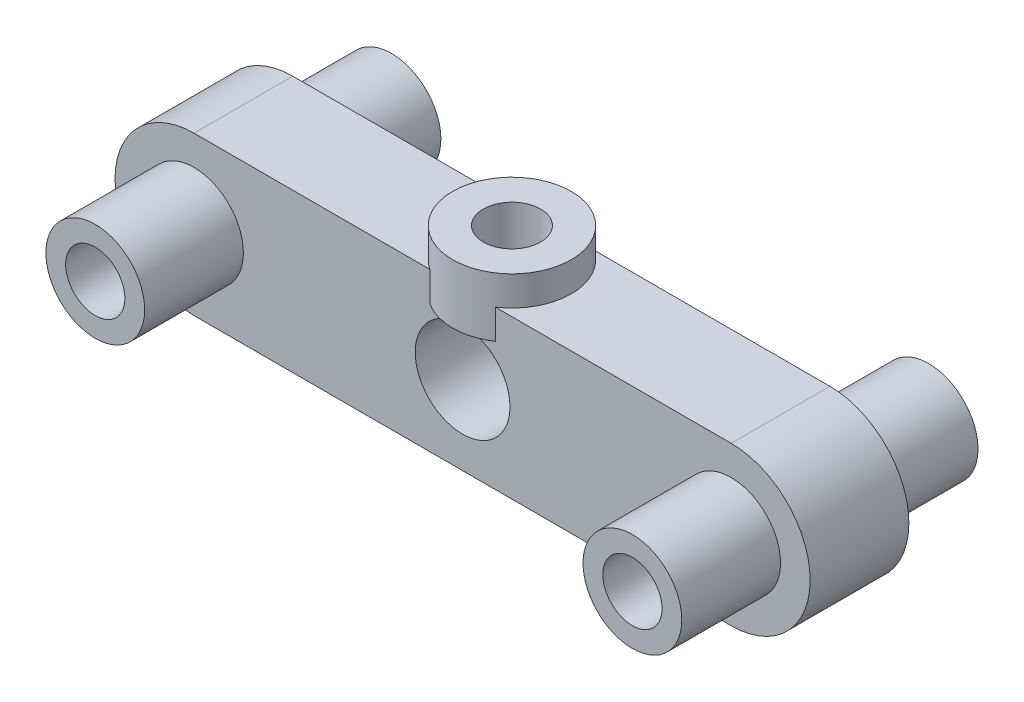
ISO-10303-21;
HEADER;
FILE_DESCRIPTION(('STEP AP214'),'2;1');
FILE_NAME('part.step','',(''),(''),'','','');
FILE_SCHEMA(('AUTOMOTIVE_DESIGN { 1 0 10303 214 1 1 1 1 }'));
ENDSEC;
DATA;
#1=APPLICATION_CONTEXT('core data for automotive mechanical design processes');
#2=APPLICATION_PROTOCOL_DEFINITION('international standard','automotive_design',2000,#1);
#3=PRODUCT_CONTEXT('',#1,'mechanical');
#4=PRODUCT('Part','Part','',(#3));
#5=PRODUCT_RELATED_PRODUCT_CATEGORY('part','',(#4));
#6=PRODUCT_DEFINITION_FORMATION('','',#4);
#7=PRODUCT_DEFINITION_CONTEXT('part definition',#1,'design');
#8=PRODUCT_DEFINITION('design','',#6,#7);
#9=PRODUCT_DEFINITION_SHAPE('','',#8);
#10=(LENGTH_UNIT() NAMED_UNIT(*) SI_UNIT(.MILLI.,.METRE.));
#11=(NAMED_UNIT(*) PLANE_ANGLE_UNIT() SI_UNIT($,.RADIAN.));
#12=(NAMED_UNIT(*) SI_UNIT($,.STERADIAN.) SOLID_ANGLE_UNIT());
#13=UNCERTAINTY_MEASURE_WITH_UNIT(LENGTH_MEASURE(1.E-05),#10,'distance_accuracy_value','');
#14=(GEOMETRIC_REPRESENTATION_CONTEXT(3) GLOBAL_UNCERTAINTY_ASSIGNED_CONTEXT((#13)) GLOBAL_UNIT_ASSIGNED_CONTEXT((#10,
#11,#12)) REPRESENTATION_CONTEXT('',''));
#15=CARTESIAN_POINT('',(0.,0.,0.));
#16=DIRECTION('',(0.,0.,1.));
#17=DIRECTION('',(1.,0.,0.));
#18=AXIS2_PLACEMENT_3D('',#15,#16,#17);
#19=CARTESIAN_POINT('',(0.,0.,0.));
#20=DIRECTION('',(0.,0.,1.));
#21=DIRECTION('',(1.,0.,0.));
#22=AXIS2_PLACEMENT_3D('',#19,#20,#21);
#23=PLANE('',#22);
#24=CARTESIAN_POINT('',(0.,0.,0.));
#25=DIRECTION('',(0.,0.,1.));
#26=DIRECTION('',(1.,0.,0.));
#27=AXIS2_PLACEMENT_3D('',#24,#25,#26);
#28=CIRCLE('',#27,1.45);
#29=CARTESIAN_POINT('',(1.45,0.,0.));
#30=VERTEX_POINT('',#29);
#31=EDGE_CURVE('E207',#30,#30,#28,.T.);
#32=ORIENTED_EDGE('',*,*,#31,.T.);
#33=EDGE_LOOP('',(#32));
#34=FACE_BOUND('',#33,.T.);
#35=CARTESIAN_POINT('',(0.,0.,0.));
#36=DIRECTION('',(0.,0.,1.));
#37=DIRECTION('',(1.,0.,0.));
#38=AXIS2_PLACEMENT_3D('',#35,#36,#37);
#39=CIRCLE('',#38,1.5);
#40=CARTESIAN_POINT('',(1.5,0.,0.));
#41=VERTEX_POINT('',#40);
#42=EDGE_CURVE('E11',#41,#41,#39,.T.);
#43=ORIENTED_EDGE('',*,*,#42,.F.);
#44=EDGE_LOOP('',(#43));
#45=FACE_BOUND('',#44,.T.);
#46=ADVANCED_FACE('F49',(#34,#45),#23,.F.);
#47=CARTESIAN_POINT('',(27.2,0.,0.));
#48=DIRECTION('',(0.,0.,1.));
#49=DIRECTION('',(1.,0.,0.));
#50=AXIS2_PLACEMENT_3D('',#47,#48,#49);
#51=CIRCLE('',#50,1.45);
#52=CARTESIAN_POINT('',(28.65,0.,0.));
#53=VERTEX_POINT('',#52);
#54=EDGE_CURVE('E211',#53,#53,#51,.T.);
#55=ORIENTED_EDGE('',*,*,#54,.T.);
#56=EDGE_LOOP('',(#55));
#57=FACE_BOUND('',#56,.T.);
#58=CARTESIAN_POINT('',(27.2,0.,0.));
#59=DIRECTION('',(0.,0.,1.));
#60=DIRECTION('',(1.,0.,0.));
#61=AXIS2_PLACEMENT_3D('',#58,#59,#60);
#62=CIRCLE('',#61,1.5);
#63=CARTESIAN_POINT('',(28.7,0.,0.));
#64=VERTEX_POINT('',#63);
#65=EDGE_CURVE('E58',#64,#64,#62,.T.);
#66=ORIENTED_EDGE('',*,*,#65,.F.);
#67=EDGE_LOOP('',(#66));
#68=FACE_BOUND('',#67,.T.);
#69=ADVANCED_FACE('F237',(#57,#68),#23,.F.);
#70=CARTESIAN_POINT('',(0.,0.,5.));
#71=DIRECTION('',(0.,0.,1.));
#72=DIRECTION('',(1.,0.,0.));
#73=AXIS2_PLACEMENT_3D('',#70,#71,#72);
#74=PLANE('',#73);
#75=CARTESIAN_POINT('',(0.,0.,5.));
#76=DIRECTION('',(0.,0.,1.));
#77=DIRECTION('',(-1.,0.,0.));
#78=AXIS2_PLACEMENT_3D('',#75,#76,#77);
#79=CIRCLE('',#78,1.45);
#80=CARTESIAN_POINT('',(-1.45,0.,5.));
#81=VERTEX_POINT('',#80);
#82=EDGE_CURVE('E305',#81,#81,#79,.T.);
#83=ORIENTED_EDGE('',*,*,#82,.F.);
#84=EDGE_LOOP('',(#83));
#85=FACE_BOUND('',#84,.T.);
#86=CARTESIAN_POINT('',(0.,0.,5.));
#87=DIRECTION('',(0.,0.,1.));
#88=DIRECTION('',(1.,0.,0.));
#89=AXIS2_PLACEMENT_3D('',#86,#87,#88);
#90=CIRCLE('',#89,1.5);
#91=CARTESIAN_POINT('',(1.5,0.,5.));
#92=VERTEX_POINT('',#91);
#93=EDGE_CURVE('E226',#92,#92,#90,.F.);
#94=ORIENTED_EDGE('',*,*,#93,.F.);
#95=EDGE_LOOP('',(#94));
#96=FACE_BOUND('',#95,.T.);
#97=ADVANCED_FACE('F239',(#85,#96),#74,.T.);
#98=CARTESIAN_POINT('',(27.2,0.,5.));
#99=DIRECTION('',(0.,0.,1.));
#100=DIRECTION('',(1.,0.,0.));
#101=AXIS2_PLACEMENT_3D('',#98,#99,#100);
#102=CIRCLE('',#101,1.45);
#103=CARTESIAN_POINT('',(28.65,0.,5.));
#104=VERTEX_POINT('',#103);
#105=EDGE_CURVE('E212',#104,#104,#102,.T.);
#106=ORIENTED_EDGE('',*,*,#105,.F.);
#107=EDGE_LOOP('',(#106));
#108=FACE_BOUND('',#107,.T.);
#109=CARTESIAN_POINT('',(27.2,0.,5.));
#110=DIRECTION('',(0.,0.,1.));
#111=DIRECTION('',(1.,0.,0.));
#112=AXIS2_PLACEMENT_3D('',#109,#110,#111);
#113=CIRCLE('',#112,1.5);
#114=CARTESIAN_POINT('',(28.7,0.,5.));
#115=VERTEX_POINT('',#114);
#116=EDGE_CURVE('E206',#115,#115,#113,.F.);
#117=ORIENTED_EDGE('',*,*,#116,.F.);
#118=EDGE_LOOP('',(#117));
#119=FACE_BOUND('',#118,.T.);
#120=ADVANCED_FACE('F248',(#108,#119),#74,.T.);
#121=CARTESIAN_POINT('',(0.,4.,5.));
#122=DIRECTION('',(0.,-1.,0.));
#123=DIRECTION('',(0.,0.,-1.));
#124=AXIS2_PLACEMENT_3D('',#121,#122,#123);
#125=PLANE('',#124);
#126=DIRECTION('',(-1.,0.,0.));
#127=VECTOR('',#126,1.);
#128=CARTESIAN_POINT('',(0.,4.,0.));
#129=LINE('',#128,#127);
#130=CARTESIAN_POINT('',(27.2,4.,0.));
#131=VERTEX_POINT('',#130);
#132=CARTESIAN_POINT('',(15.2583123951777,4.,0.));
#133=VERTEX_POINT('',#132);
#134=EDGE_CURVE('E165',#131,#133,#129,.T.);
#135=ORIENTED_EDGE('',*,*,#134,.T.);
#136=CARTESIAN_POINT('',(13.6,4.,2.5));
#137=DIRECTION('',(0.,-1.,0.));
#138=DIRECTION('',(0.,0.,-1.));
#139=AXIS2_PLACEMENT_3D('',#136,#137,#138);
#140=CIRCLE('',#139,3.);
#141=CARTESIAN_POINT('',(15.2583123951777,4.,5.));
#142=VERTEX_POINT('',#141);
#143=EDGE_CURVE('E202',#133,#142,#140,.T.);
#144=ORIENTED_EDGE('',*,*,#143,.T.);
#145=DIRECTION('',(-1.,0.,0.));
#146=VECTOR('',#145,1.);
#147=CARTESIAN_POINT('',(0.,4.,5.));
#148=LINE('',#147,#146);
#149=CARTESIAN_POINT('',(27.2,4.,5.));
#150=VERTEX_POINT('',#149);
#151=EDGE_CURVE('E171',#150,#142,#148,.T.);
#152=ORIENTED_EDGE('',*,*,#151,.F.);
#153=DIRECTION('',(0.,0.,-1.));
#154=VECTOR('',#153,1.);
#155=CARTESIAN_POINT('',(27.2,4.,5.));
#156=LINE('',#155,#154);
#157=EDGE_CURVE('E189',#150,#131,#156,.T.);
#158=ORIENTED_EDGE('',*,*,#157,.T.);
#159=EDGE_LOOP('',(#135,#144,#152,#158));
#160=FACE_BOUND('',#159,.T.);
#161=ADVANCED_FACE('F261',(#160),#125,.F.);
#162=CARTESIAN_POINT('',(0.,0.,5.));
#163=DIRECTION('',(0.,0.,1.));
#164=DIRECTION('',(1.,0.,0.));
#165=AXIS2_PLACEMENT_3D('',#162,#163,#164);
#166=CIRCLE('',#165,2.5);
#167=CARTESIAN_POINT('',(2.5,0.,5.));
#168=VERTEX_POINT('',#167);
#169=EDGE_CURVE('E426',#168,#168,#166,.T.);
#170=ORIENTED_EDGE('',*,*,#169,.F.);
#171=EDGE_LOOP('',(#170));
#172=FACE_BOUND('',#171,.T.);
#173=CARTESIAN_POINT('',(27.2,0.,5.));
#174=DIRECTION('',(0.,0.,1.));
#175=DIRECTION('',(1.,0.,0.));
#176=AXIS2_PLACEMENT_3D('',#173,#174,#175);
#177=CIRCLE('',#176,2.5);
#178=CARTESIAN_POINT('',(29.7,0.,5.));
#179=VERTEX_POINT('',#178);
#180=EDGE_CURVE('E306',#179,#179,#177,.T.);
#181=ORIENTED_EDGE('',*,*,#180,.F.);
#182=EDGE_LOOP('',(#181));
#183=FACE_BOUND('',#182,.T.);
#184=DIRECTION('',(0.,1.,0.));
#185=VECTOR('',#184,1.);
#186=CARTESIAN_POINT('',(15.2583123951777,2.5,5.));
#187=LINE('',#186,#185);
#188=CARTESIAN_POINT('',(15.2583123951777,2.5,5.));
#189=VERTEX_POINT('',#188);
#190=EDGE_CURVE('E144',#189,#142,#187,.T.);
#191=ORIENTED_EDGE('',*,*,#190,.F.);
#192=DIRECTION('',(-1.,0.,0.));
#193=VECTOR('',#192,1.);
#194=CARTESIAN_POINT('',(0.,2.5,5.));
#195=LINE('',#194,#193);
#196=CARTESIAN_POINT('',(11.9416876048223,2.5,5.));
#197=VERTEX_POINT('',#196);
#198=EDGE_CURVE('E137',#189,#197,#195,.T.);
#199=ORIENTED_EDGE('',*,*,#198,.T.);
#200=DIRECTION('',(0.,1.,0.));
#201=VECTOR('',#200,1.);
#202=CARTESIAN_POINT('',(11.9416876048223,2.5,5.));
#203=LINE('',#202,#201);
#204=CARTESIAN_POINT('',(11.9416876048223,4.,5.));
#205=VERTEX_POINT('',#204);
#206=EDGE_CURVE('E124',#205,#197,#203,.F.);
#207=ORIENTED_EDGE('',*,*,#206,.F.);
#208=CARTESIAN_POINT('',(0.,4.,5.));
#209=VERTEX_POINT('',#208);
#210=EDGE_CURVE('E74',#205,#209,#148,.T.);
#211=ORIENTED_EDGE('',*,*,#210,.T.);
#212=CARTESIAN_POINT('',(0.,0.,5.));
#213=DIRECTION('',(0.,0.,1.));
#214=DIRECTION('',(1.,0.,0.));
#215=AXIS2_PLACEMENT_3D('',#212,#213,#214);
#216=CIRCLE('',#215,4.);
#217=CARTESIAN_POINT('',(0.,-4.,5.));
#218=VERTEX_POINT('',#217);
#219=EDGE_CURVE('E162',#209,#218,#216,.T.);
#220=ORIENTED_EDGE('',*,*,#219,.T.);
#221=DIRECTION('',(1.,0.,0.));
#222=VECTOR('',#221,1.);
#223=CARTESIAN_POINT('',(0.,-4.,5.));
#224=LINE('',#223,#222);
#225=CARTESIAN_POINT('',(27.2,-4.,5.));
#226=VERTEX_POINT('',#225);
#227=EDGE_CURVE('E103',#218,#226,#224,.T.);
#228=ORIENTED_EDGE('',*,*,#227,.T.);
#229=CARTESIAN_POINT('',(27.2,0.,5.));
#230=DIRECTION('',(0.,0.,1.));
#231=DIRECTION('',(1.,0.,0.));
#232=AXIS2_PLACEMENT_3D('',#229,#230,#231);
#233=CIRCLE('',#232,4.);
#234=EDGE_CURVE('E168',#226,#150,#233,.T.);
#235=ORIENTED_EDGE('',*,*,#234,.T.);
#236=ORIENTED_EDGE('',*,*,#151,.T.);
#237=EDGE_LOOP('',(#191,#199,#207,#211,#220,#228,#235,#236));
#238=FACE_BOUND('',#237,.T.);
#239=CARTESIAN_POINT('',(13.6,0.,5.));
#240=DIRECTION('',(0.,0.,1.));
#241=DIRECTION('',(1.,0.,0.));
#242=AXIS2_PLACEMENT_3D('',#239,#240,#241);
#243=CIRCLE('',#242,2.4);
#244=CARTESIAN_POINT('',(16.,0.,5.));
#245=VERTEX_POINT('',#244);
#246=EDGE_CURVE('E153',#245,#245,#243,.T.);
#247=ORIENTED_EDGE('',*,*,#246,.F.);
#248=EDGE_LOOP('',(#247));
#249=FACE_BOUND('',#248,.T.);
#250=ADVANCED_FACE('F141',(#172,#183,#238,#249),#74,.T.);
#251=CARTESIAN_POINT('',(0.,0.,0.));
#252=DIRECTION('',(0.,0.,1.));
#253=DIRECTION('',(1.,0.,0.));
#254=AXIS2_PLACEMENT_3D('',#251,#252,#253);
#255=CIRCLE('',#254,2.5);
#256=CARTESIAN_POINT('',(2.5,0.,0.));
#257=VERTEX_POINT('',#256);
#258=EDGE_CURVE('E266',#257,#257,#255,.T.);
#259=ORIENTED_EDGE('',*,*,#258,.T.);
#260=EDGE_LOOP('',(#259));
#261=FACE_BOUND('',#260,.T.);
#262=CARTESIAN_POINT('',(27.2,0.,0.));
#263=DIRECTION('',(0.,0.,1.));
#264=DIRECTION('',(1.,0.,0.));
#265=AXIS2_PLACEMENT_3D('',#262,#263,#264);
#266=CIRCLE('',#265,2.5);
#267=CARTESIAN_POINT('',(29.7,0.,0.));
#268=VERTEX_POINT('',#267);
#269=EDGE_CURVE('E270',#268,#268,#266,.T.);
#270=ORIENTED_EDGE('',*,*,#269,.T.);
#271=EDGE_LOOP('',(#270));
#272=FACE_BOUND('',#271,.T.);
#273=DIRECTION('',(-1.,0.,0.));
#274=VECTOR('',#273,1.);
#275=CARTESIAN_POINT('',(0.,2.5,0.));
#276=LINE('',#275,#274);
#277=CARTESIAN_POINT('',(15.2583123951777,2.5,0.));
#278=VERTEX_POINT('',#277);
#279=CARTESIAN_POINT('',(11.9416876048223,2.5,0.));
#280=VERTEX_POINT('',#279);
#281=EDGE_CURVE('E203',#278,#280,#276,.T.);
#282=ORIENTED_EDGE('',*,*,#281,.F.);
#283=DIRECTION('',(0.,1.,0.));
#284=VECTOR('',#283,1.);
#285=CARTESIAN_POINT('',(15.2583123951777,2.5,0.));
#286=LINE('',#285,#284);
#287=EDGE_CURVE('E133',#278,#133,#286,.T.);
#288=ORIENTED_EDGE('',*,*,#287,.T.);
#289=ORIENTED_EDGE('',*,*,#134,.F.);
#290=CARTESIAN_POINT('',(27.2,0.,0.));
#291=DIRECTION('',(0.,0.,1.));
#292=DIRECTION('',(1.,0.,0.));
#293=AXIS2_PLACEMENT_3D('',#290,#291,#292);
#294=CIRCLE('',#293,4.);
#295=CARTESIAN_POINT('',(27.2,-4.,0.));
#296=VERTEX_POINT('',#295);
#297=EDGE_CURVE('E181',#296,#131,#294,.T.);
#298=ORIENTED_EDGE('',*,*,#297,.F.);
#299=DIRECTION('',(1.,0.,0.));
#300=VECTOR('',#299,1.);
#301=CARTESIAN_POINT('',(0.,-4.,0.));
#302=LINE('',#301,#300);
#303=CARTESIAN_POINT('',(0.,-4.,0.));
#304=VERTEX_POINT('',#303);
#305=EDGE_CURVE('E178',#304,#296,#302,.T.);
#306=ORIENTED_EDGE('',*,*,#305,.F.);
#307=CARTESIAN_POINT('',(0.,0.,0.));
#308=DIRECTION('',(0.,0.,1.));
#309=DIRECTION('',(1.,0.,0.));
#310=AXIS2_PLACEMENT_3D('',#307,#308,#309);
#311=CIRCLE('',#310,4.);
#312=CARTESIAN_POINT('',(0.,4.,0.));
#313=VERTEX_POINT('',#312);
#314=EDGE_CURVE('E160',#313,#304,#311,.T.);
#315=ORIENTED_EDGE('',*,*,#314,.F.);
#316=CARTESIAN_POINT('',(11.9416876048223,4.,0.));
#317=VERTEX_POINT('',#316);
#318=EDGE_CURVE('E95',#317,#313,#129,.T.);
#319=ORIENTED_EDGE('',*,*,#318,.F.);
#320=DIRECTION('',(0.,1.,0.));
#321=VECTOR('',#320,1.);
#322=CARTESIAN_POINT('',(11.9416876048223,2.5,0.));
#323=LINE('',#322,#321);
#324=EDGE_CURVE('E65',#317,#280,#323,.F.);
#325=ORIENTED_EDGE('',*,*,#324,.T.);
#326=EDGE_LOOP('',(#282,#288,#289,#298,#306,#315,#319,#325));
#327=FACE_BOUND('',#326,.T.);
#328=CARTESIAN_POINT('',(13.6,0.,0.));
#329=DIRECTION('',(0.,0.,1.));
#330=DIRECTION('',(1.,0.,0.));
#331=AXIS2_PLACEMENT_3D('',#328,#329,#330);
#332=CIRCLE('',#331,2.4);
#333=CARTESIAN_POINT('',(16.,0.,0.));
#334=VERTEX_POINT('',#333);
#335=EDGE_CURVE('E146',#334,#334,#332,.T.);
#336=ORIENTED_EDGE('',*,*,#335,.T.);
#337=EDGE_LOOP('',(#336));
#338=FACE_BOUND('',#337,.T.);
#339=ADVANCED_FACE('F242',(#261,#272,#327,#338),#23,.F.);
#340=CARTESIAN_POINT('',(0.,0.,5.));
#341=DIRECTION('',(0.,0.,-1.));
#342=DIRECTION('',(-1.,0.,0.));
#343=AXIS2_PLACEMENT_3D('',#340,#341,#342);
#344=CYLINDRICAL_SURFACE('',#343,4.);
#345=ORIENTED_EDGE('',*,*,#314,.T.);
#346=DIRECTION('',(0.,0.,-1.));
#347=VECTOR('',#346,1.);
#348=CARTESIAN_POINT('',(0.,-4.,5.));
#349=LINE('',#348,#347);
#350=EDGE_CURVE('E197',#218,#304,#349,.T.);
#351=ORIENTED_EDGE('',*,*,#350,.F.);
#352=ORIENTED_EDGE('',*,*,#219,.F.);
#353=DIRECTION('',(0.,0.,-1.));
#354=VECTOR('',#353,1.);
#355=CARTESIAN_POINT('',(0.,4.,5.));
#356=LINE('',#355,#354);
#357=EDGE_CURVE('E174',#209,#313,#356,.T.);
#358=ORIENTED_EDGE('',*,*,#357,.T.);
#359=EDGE_LOOP('',(#345,#351,#352,#358));
#360=FACE_BOUND('',#359,.T.);
#361=ADVANCED_FACE('F51',(#360),#344,.T.);
#362=CARTESIAN_POINT('',(0.,-4.,5.));
#363=DIRECTION('',(0.,1.,0.));
#364=DIRECTION('',(0.,0.,1.));
#365=AXIS2_PLACEMENT_3D('',#362,#363,#364);
#366=PLANE('',#365);
#367=ORIENTED_EDGE('',*,*,#305,.T.);
#368=DIRECTION('',(0.,0.,-1.));
#369=VECTOR('',#368,1.);
#370=CARTESIAN_POINT('',(27.2,-4.,5.));
#371=LINE('',#370,#369);
#372=EDGE_CURVE('E193',#226,#296,#371,.T.);
#373=ORIENTED_EDGE('',*,*,#372,.F.);
#374=ORIENTED_EDGE('',*,*,#227,.F.);
#375=ORIENTED_EDGE('',*,*,#350,.T.);
#376=EDGE_LOOP('',(#367,#373,#374,#375));
#377=FACE_BOUND('',#376,.T.);
#378=ADVANCED_FACE('F258',(#377),#366,.F.);
#379=CARTESIAN_POINT('',(27.2,0.,5.));
#380=DIRECTION('',(0.,0.,-1.));
#381=DIRECTION('',(-1.,0.,0.));
#382=AXIS2_PLACEMENT_3D('',#379,#380,#381);
#383=CYLINDRICAL_SURFACE('',#382,4.);
#384=ORIENTED_EDGE('',*,*,#297,.T.);
#385=ORIENTED_EDGE('',*,*,#157,.F.);
#386=ORIENTED_EDGE('',*,*,#234,.F.);
#387=ORIENTED_EDGE('',*,*,#372,.T.);
#388=EDGE_LOOP('',(#384,#385,#386,#387));
#389=FACE_BOUND('',#388,.T.);
#390=ADVANCED_FACE('F290',(#389),#383,.T.);
#391=ORIENTED_EDGE('',*,*,#210,.F.);
#392=EDGE_CURVE('E130',#205,#317,#140,.T.);
#393=ORIENTED_EDGE('',*,*,#392,.T.);
#394=ORIENTED_EDGE('',*,*,#318,.T.);
#395=ORIENTED_EDGE('',*,*,#357,.F.);
#396=EDGE_LOOP('',(#391,#393,#394,#395));
#397=FACE_BOUND('',#396,.T.);
#398=ADVANCED_FACE('F279',(#397),#125,.F.);
#399=CARTESIAN_POINT('',(13.6,0.,5.));
#400=DIRECTION('',(0.,0.,-1.));
#401=DIRECTION('',(-1.,0.,0.));
#402=AXIS2_PLACEMENT_3D('',#399,#400,#401);
#403=CYLINDRICAL_SURFACE('',#402,2.4);
#404=CARTESIAN_POINT('',(12.15,1.91245914989053,2.5));
#405=CARTESIAN_POINT('',(12.1500101565943,1.91247379180866,2.42731646557288));
#406=CARTESIAN_POINT('',(12.1555140795533,1.91667918503255,2.35451512219227));
#407=CARTESIAN_POINT('',(12.1771752753107,1.93280513897264,2.21128461719401));
#408=CARTESIAN_POINT('',(12.1933656308505,1.94474965612285,2.14086353828301));
#409=CARTESIAN_POINT('',(12.2352973360836,1.97439453655365,2.00491672855246));
#410=CARTESIAN_POINT('',(12.2609605513339,1.99204767013351,1.93935607708928));
#411=CARTESIAN_POINT('',(12.3208807759894,2.0310413377372,1.81354923389214));
#412=CARTESIAN_POINT('',(12.3551369116106,2.05238149677165,1.75330250264561));
#413=CARTESIAN_POINT('',(12.4362405864687,2.09955383443775,1.63157804693358));
#414=CARTESIAN_POINT('',(12.4841241983416,2.12561460815905,1.57087894562029));
#415=CARTESIAN_POINT('',(12.5890043587751,2.17745614164241,1.45772107670103));
#416=CARTESIAN_POINT('',(12.6460084655696,2.20323665005583,1.40526921576568));
#417=CARTESIAN_POINT('',(12.7751119332333,2.25497358418559,1.30439040495826));
#418=CARTESIAN_POINT('',(12.8481820101548,2.28063744290677,1.25704078846955));
#419=CARTESIAN_POINT('',(13.0030963313752,2.32598278530178,1.17567466834384));
#420=CARTESIAN_POINT('',(13.0849322806411,2.34566985824538,1.14164569905433));
#421=CARTESIAN_POINT('',(13.2467169470789,2.37513898261201,1.09139915242136));
#422=CARTESIAN_POINT('',(13.3260859840848,2.3856934152669,1.07377988743637));
#423=CARTESIAN_POINT('',(13.4872818953652,2.39870995875905,1.05210883513017));
#424=CARTESIAN_POINT('',(13.5691063376862,2.40117982628165,1.04804404298475));
#425=CARTESIAN_POINT('',(13.7217943866822,2.39796977014427,1.05336344618846));
#426=CARTESIAN_POINT('',(13.7927431658763,2.39327504499147,1.0611216680991));
#427=CARTESIAN_POINT('',(13.932110244702,2.37794376130261,1.0867687797553));
#428=CARTESIAN_POINT('',(14.0005283532057,2.36730675495106,1.10465843301573));
#429=CARTESIAN_POINT('',(14.1335089218343,2.3409386256409,1.14987720549146));
#430=CARTESIAN_POINT('',(14.198049027884,2.32518080562213,1.17725584585147));
#431=CARTESIAN_POINT('',(14.3216935649292,2.28982509817777,1.24044295342338));
#432=CARTESIAN_POINT('',(14.3807966103276,2.27022623585082,1.27625356123277));
#433=CARTESIAN_POINT('',(14.4995135810191,2.22606211117948,1.36014197324983));
#434=CARTESIAN_POINT('',(14.5583333539926,2.20118302254125,1.40917733782279));
#435=CARTESIAN_POINT('',(14.6674151528151,2.15040783828845,1.51564965506741));
#436=CARTESIAN_POINT('',(14.7176652283073,2.12451038346858,1.57309813570507));
#437=CARTESIAN_POINT('',(14.8141955837336,2.07101840343846,1.70280573223694));
#438=CARTESIAN_POINT('',(14.8593027471235,2.04358561540304,1.77601297995626));
#439=CARTESIAN_POINT('',(14.9363400881795,1.99406694870243,1.93068180403552));
#440=CARTESIAN_POINT('',(14.9682945987536,1.97197122784944,2.01212778733733));
#441=CARTESIAN_POINT('',(15.0111431365432,1.94143914315396,2.16009783780526));
#442=CARTESIAN_POINT('',(15.0253066393308,1.93096814651298,2.2252543157333));
#443=CARTESIAN_POINT('',(15.0445318811462,1.91663199512447,2.35758037635779));
#444=CARTESIAN_POINT('',(15.0496045003344,1.91275894409191,2.4247474546612));
#445=CARTESIAN_POINT('',(15.0503514341864,1.91219276521747,2.55926533299643));
#446=CARTESIAN_POINT('',(15.0460114480318,1.91551056261516,2.62661625709447));
#447=CARTESIAN_POINT('',(15.0281784491639,1.92884015309191,2.75943094962891));
#448=CARTESIAN_POINT('',(15.0146781307808,1.93885728902483,2.82489316828397));
#449=CARTESIAN_POINT('',(14.9792890403242,1.96418607483583,2.95211871271675));
#450=CARTESIAN_POINT('',(14.9574304193315,1.97947867524178,3.01389442151066));
#451=CARTESIAN_POINT('',(14.9061047391239,2.0137130888461,3.13309313894611));
#452=CARTESIAN_POINT('',(14.8766348428032,2.03265626212722,3.1905145141612));
#453=CARTESIAN_POINT('',(14.8047365415927,2.07621753386037,3.31046263714574));
#454=CARTESIAN_POINT('',(14.7609255594031,2.10124083605449,3.37201448268204));
#455=CARTESIAN_POINT('',(14.6643971578831,2.15175091345617,3.48753890871226));
#456=CARTESIAN_POINT('',(14.6116710724192,2.17723811789046,3.54150401995677));
#457=CARTESIAN_POINT('',(14.4903274165226,2.2298550198705,3.6476748519681));
#458=CARTESIAN_POINT('',(14.4205257220205,2.25674287254008,3.6986624181704));
#459=CARTESIAN_POINT('',(14.2716378520505,2.30543291181954,3.78799153592953));
#460=CARTESIAN_POINT('',(14.1925576321274,2.32723833409791,3.82634113976635));
#461=CARTESIAN_POINT('',(14.0330528871574,2.36191505394789,3.88625224789114));
#462=CARTESIAN_POINT('',(13.9531212852373,2.37531021141657,3.90881133419387));
#463=CARTESIAN_POINT('',(13.7896824668653,2.39389980186034,3.93993648453149));
#464=CARTESIAN_POINT('',(13.7061795576304,2.39910384245561,3.94851894260598));
#465=CARTESIAN_POINT('',(13.5502773254942,2.40057696563398,3.95095303099027));
#466=CARTESIAN_POINT('',(13.4779095376563,2.39796310094531,3.9466462667786));
#467=CARTESIAN_POINT('',(13.3351245202578,2.38641328056656,3.92742007897259));
#468=CARTESIAN_POINT('',(13.2647072970332,2.37747730434275,3.91250062090904));
#469=CARTESIAN_POINT('',(13.1290173202399,2.35432165788027,3.87316296015259));
#470=CARTESIAN_POINT('',(13.0636724724688,2.34020508102566,3.84892968390394));
#471=CARTESIAN_POINT('',(12.9379760161301,2.30780026077909,3.79189474362211));
#472=CARTESIAN_POINT('',(12.8776254526894,2.28951114721595,3.75909129209479));
#473=CARTESIAN_POINT('',(12.7565965596495,2.24793109493194,3.68189083782577));
#474=CARTESIAN_POINT('',(12.6965865606403,2.22431329983709,3.63662442184387));
#475=CARTESIAN_POINT('',(12.5845490468541,2.17545481469601,3.53776272406993));
#476=CARTESIAN_POINT('',(12.5325309284569,2.15021226307111,3.48415778505678));
#477=CARTESIAN_POINT('',(12.4310030699826,2.09693588595498,3.36200441933285));
#478=CARTESIAN_POINT('',(12.3826991444413,2.06896593965901,3.2924192239187));
#479=CARTESIAN_POINT('',(12.2984541752325,2.01703594337409,3.14473471097648));
#480=CARTESIAN_POINT('',(12.2625032666458,1.99307270158462,3.06664225316196));
#481=CARTESIAN_POINT('',(12.2110697068767,1.9574533219783,2.92177390628711));
#482=CARTESIAN_POINT('',(12.1928088742355,1.94424379859729,2.85636620270286));
#483=CARTESIAN_POINT('',(12.1656133748831,1.92427475374827,2.72280224892782));
#484=CARTESIAN_POINT('',(12.1566475607767,1.91749369721491,2.65465597838959));
#485=CARTESIAN_POINT('',(12.1508514615083,1.91310320733193,2.55747959038812));
#486=CARTESIAN_POINT('',(12.1499959826934,1.91245335847346,2.52874901076056));
#487=CARTESIAN_POINT('',(12.15,1.91245914989053,2.5));
#488=B_SPLINE_CURVE_WITH_KNOTS('',3,(#404,#405,#406,#407,#408,#409,#410,#411,#412,#413,#414,
#415,#416,#417,#418,#419,#420,#421,#422,#423,#424,#425,#426,#427,#428,#429,#430,#431,#432,#433,
#434,#435,#436,#437,#438,#439,#440,#441,#442,#443,#444,#445,#446,#447,#448,#449,#450,#451,#452,
#453,#454,#455,#456,#457,#458,#459,#460,#461,#462,#463,#464,#465,#466,#467,#468,#469,#470,#471,
#472,#473,#474,#475,#476,#477,#478,#479,#480,#481,#482,#483,#484,#485,#486,#487),.UNSPECIFIED.,
.T.,.F.,(4,2,2,2,2,2,2,2,2,2,2,2,2,2,2,2,2,2,2,2,2,2,2,2,2,2,2,2,2,2,2,2,2,2,2,2,2,2,2,2,2,4),
(0.,0.217948064445006,0.436574030651572,0.653435606772189,0.870275139929569,1.11408035014652,
1.35808866045615,1.62893671925055,1.89953070512314,2.14401779580844,2.38827024602435,
2.60182681795742,2.81539948587102,3.03010396182938,3.24486300302773,3.48546173254142,
3.72639327876408,3.99583075564257,4.26476749785747,4.4663899284069,4.6677708914369,
4.86945803216088,5.0713062144505,5.27243303174852,5.47363492762341,5.71148172420783,
5.94956106869435,6.21973915121176,6.48974475538173,6.74060501318256,6.99117080919529,
7.20772121368279,7.42427232151252,7.63672908998205,7.84923020629942,8.08467810462293,
8.32040074437507,8.58677642910808,8.85293889342874,9.05965305121431,9.26567225333029,
9.3518787277314),.UNSPECIFIED.);
#489=CARTESIAN_POINT('',(12.15,1.91245914989053,2.5));
#490=VERTEX_POINT('',#489);
#491=EDGE_CURVE('E221',#490,#490,#488,.T.);
#492=ORIENTED_EDGE('',*,*,#491,.F.);
#493=EDGE_LOOP('',(#492));
#494=FACE_BOUND('',#493,.T.);
#495=ORIENTED_EDGE('',*,*,#246,.T.);
#496=EDGE_LOOP('',(#495));
#497=FACE_BOUND('',#496,.T.);
#498=ORIENTED_EDGE('',*,*,#335,.F.);
#499=EDGE_LOOP('',(#498));
#500=FACE_BOUND('',#499,.T.);
#501=ADVANCED_FACE('F276',(#494,#497,#500),#403,.F.);
#502=CARTESIAN_POINT('',(13.6,2.5,2.5));
#503=DIRECTION('',(0.,1.,0.));
#504=DIRECTION('',(-1.,0.,0.));
#505=AXIS2_PLACEMENT_3D('',#502,#503,#504);
#506=PLANE('',#505);
#507=CARTESIAN_POINT('',(13.6,2.5,2.5));
#508=DIRECTION('',(0.,1.,0.));
#509=DIRECTION('',(-1.,0.,0.));
#510=AXIS2_PLACEMENT_3D('',#507,#508,#509);
#511=CIRCLE('',#510,3.);
#512=EDGE_CURVE('E139',#278,#280,#511,.T.);
#513=ORIENTED_EDGE('',*,*,#512,.F.);
#514=ORIENTED_EDGE('',*,*,#281,.T.);
#515=EDGE_LOOP('',(#513,#514));
#516=FACE_BOUND('',#515,.T.);
#517=ADVANCED_FACE('F278',(#516),#506,.F.);
#518=CARTESIAN_POINT('',(13.6,2.5,2.5));
#519=DIRECTION('',(0.,1.,0.));
#520=DIRECTION('',(-1.,0.,0.));
#521=AXIS2_PLACEMENT_3D('',#518,#519,#520);
#522=CYLINDRICAL_SURFACE('',#521,3.);
#523=EDGE_CURVE('E128',#197,#189,#511,.T.);
#524=ORIENTED_EDGE('',*,*,#523,.T.);
#525=ORIENTED_EDGE('',*,*,#190,.T.);
#526=ORIENTED_EDGE('',*,*,#143,.F.);
#527=ORIENTED_EDGE('',*,*,#287,.F.);
#528=ORIENTED_EDGE('',*,*,#512,.T.);
#529=ORIENTED_EDGE('',*,*,#324,.F.);
#530=ORIENTED_EDGE('',*,*,#392,.F.);
#531=ORIENTED_EDGE('',*,*,#206,.T.);
#532=EDGE_LOOP('',(#524,#525,#526,#527,#528,#529,#530,#531));
#533=FACE_BOUND('',#532,.T.);
#534=CARTESIAN_POINT('',(13.6,5.5,2.5));
#535=DIRECTION('',(0.,1.,0.));
#536=DIRECTION('',(-1.,0.,0.));
#537=AXIS2_PLACEMENT_3D('',#534,#535,#536);
#538=CIRCLE('',#537,3.);
#539=CARTESIAN_POINT('',(10.6,5.5,2.5));
#540=VERTEX_POINT('',#539);
#541=EDGE_CURVE('E216',#540,#540,#538,.T.);
#542=ORIENTED_EDGE('',*,*,#541,.F.);
#543=EDGE_LOOP('',(#542));
#544=FACE_BOUND('',#543,.T.);
#545=ADVANCED_FACE('F126',(#533,#544),#522,.T.);
#546=ORIENTED_EDGE('',*,*,#198,.F.);
#547=ORIENTED_EDGE('',*,*,#523,.F.);
#548=EDGE_LOOP('',(#546,#547));
#549=FACE_BOUND('',#548,.T.);
#550=ADVANCED_FACE('F136',(#549),#506,.F.);
#551=CARTESIAN_POINT('',(13.6,5.5,2.5));
#552=DIRECTION('',(0.,1.,0.));
#553=DIRECTION('',(-1.,0.,0.));
#554=AXIS2_PLACEMENT_3D('',#551,#552,#553);
#555=PLANE('',#554);
#556=CARTESIAN_POINT('',(13.6,5.5,2.5));
#557=DIRECTION('',(0.,1.,0.));
#558=DIRECTION('',(-1.,0.,0.));
#559=AXIS2_PLACEMENT_3D('',#556,#557,#558);
#560=CIRCLE('',#559,1.45);
#561=CARTESIAN_POINT('',(12.15,5.5,2.5));
#562=VERTEX_POINT('',#561);
#563=EDGE_CURVE('E217',#562,#562,#560,.T.);
#564=ORIENTED_EDGE('',*,*,#563,.F.);
#565=EDGE_LOOP('',(#564));
#566=FACE_BOUND('',#565,.T.);
#567=ORIENTED_EDGE('',*,*,#541,.T.);
#568=EDGE_LOOP('',(#567));
#569=FACE_BOUND('',#568,.T.);
#570=ADVANCED_FACE('F323',(#566,#569),#555,.T.);
#571=CARTESIAN_POINT('',(0.,0.,-4.));
#572=DIRECTION('',(0.,0.,1.));
#573=DIRECTION('',(1.,0.,0.));
#574=AXIS2_PLACEMENT_3D('',#571,#572,#573);
#575=CYLINDRICAL_SURFACE('',#574,1.45);
#576=ORIENTED_EDGE('',*,*,#82,.T.);
#577=EDGE_LOOP('',(#576));
#578=FACE_BOUND('',#577,.T.);
#579=ORIENTED_EDGE('',*,*,#31,.F.);
#580=EDGE_LOOP('',(#579));
#581=FACE_BOUND('',#580,.T.);
#582=ADVANCED_FACE('F320',(#578,#581),#575,.F.);
#583=CARTESIAN_POINT('',(27.2,0.,-4.));
#584=DIRECTION('',(0.,0.,1.));
#585=DIRECTION('',(1.,0.,0.));
#586=AXIS2_PLACEMENT_3D('',#583,#584,#585);
#587=CYLINDRICAL_SURFACE('',#586,1.45);
#588=ORIENTED_EDGE('',*,*,#105,.T.);
#589=EDGE_LOOP('',(#588));
#590=FACE_BOUND('',#589,.T.);
#591=ORIENTED_EDGE('',*,*,#54,.F.);
#592=EDGE_LOOP('',(#591));
#593=FACE_BOUND('',#592,.T.);
#594=ADVANCED_FACE('F315',(#590,#593),#587,.F.);
#595=CARTESIAN_POINT('',(13.6,0.,2.5));
#596=DIRECTION('',(0.,1.,0.));
#597=DIRECTION('',(-1.,0.,0.));
#598=AXIS2_PLACEMENT_3D('',#595,#596,#597);
#599=CYLINDRICAL_SURFACE('',#598,1.45);
#600=ORIENTED_EDGE('',*,*,#491,.T.);
#601=EDGE_LOOP('',(#600));
#602=FACE_BOUND('',#601,.T.);
#603=ORIENTED_EDGE('',*,*,#563,.T.);
#604=EDGE_LOOP('',(#603));
#605=FACE_BOUND('',#604,.T.);
#606=ADVANCED_FACE('F309',(#602,#605),#599,.F.);
#607=CARTESIAN_POINT('',(27.2,0.,10.));
#608=DIRECTION('',(0.,0.,1.));
#609=DIRECTION('',(1.,0.,0.));
#610=AXIS2_PLACEMENT_3D('',#607,#608,#609);
#611=PLANE('',#610);
#612=CARTESIAN_POINT('',(27.2,0.,10.));
#613=DIRECTION('',(0.,0.,1.));
#614=DIRECTION('',(1.,0.,0.));
#615=AXIS2_PLACEMENT_3D('',#612,#613,#614);
#616=CIRCLE('',#615,2.5);
#617=CARTESIAN_POINT('',(29.7,0.,10.));
#618=VERTEX_POINT('',#617);
#619=EDGE_CURVE('E222',#618,#618,#616,.T.);
#620=ORIENTED_EDGE('',*,*,#619,.T.);
#621=EDGE_LOOP('',(#620));
#622=FACE_BOUND('',#621,.T.);
#623=CARTESIAN_POINT('',(27.2,0.,10.));
#624=DIRECTION('',(0.,0.,1.));
#625=DIRECTION('',(1.,0.,0.));
#626=AXIS2_PLACEMENT_3D('',#623,#624,#625);
#627=CIRCLE('',#626,1.5);
#628=CARTESIAN_POINT('',(28.7,0.,10.));
#629=VERTEX_POINT('',#628);
#630=EDGE_CURVE('E415',#629,#629,#627,.T.);
#631=ORIENTED_EDGE('',*,*,#630,.F.);
#632=EDGE_LOOP('',(#631));
#633=FACE_BOUND('',#632,.T.);
#634=ADVANCED_FACE('F314',(#622,#633),#611,.T.);
#635=CARTESIAN_POINT('',(27.2,0.,10.));
#636=DIRECTION('',(0.,0.,-1.));
#637=DIRECTION('',(-1.,0.,0.));
#638=AXIS2_PLACEMENT_3D('',#635,#636,#637);
#639=CYLINDRICAL_SURFACE('',#638,2.5);
#640=ORIENTED_EDGE('',*,*,#619,.F.);
#641=EDGE_LOOP('',(#640));
#642=FACE_BOUND('',#641,.T.);
#643=ORIENTED_EDGE('',*,*,#180,.T.);
#644=EDGE_LOOP('',(#643));
#645=FACE_BOUND('',#644,.T.);
#646=ADVANCED_FACE('F317',(#642,#645),#639,.T.);
#647=CARTESIAN_POINT('',(27.2,0.,10.));
#648=DIRECTION('',(0.,0.,-1.));
#649=DIRECTION('',(-1.,0.,0.));
#650=AXIS2_PLACEMENT_3D('',#647,#648,#649);
#651=CYLINDRICAL_SURFACE('',#650,1.5);
#652=ORIENTED_EDGE('',*,*,#630,.T.);
#653=EDGE_LOOP('',(#652));
#654=FACE_BOUND('',#653,.T.);
#655=ORIENTED_EDGE('',*,*,#116,.T.);
#656=EDGE_LOOP('',(#655));
#657=FACE_BOUND('',#656,.T.);
#658=ADVANCED_FACE('F509',(#654,#657),#651,.F.);
#659=CARTESIAN_POINT('',(0.,0.,10.));
#660=DIRECTION('',(0.,0.,1.));
#661=DIRECTION('',(1.,0.,0.));
#662=AXIS2_PLACEMENT_3D('',#659,#660,#661);
#663=PLANE('',#662);
#664=CARTESIAN_POINT('',(0.,0.,10.));
#665=DIRECTION('',(0.,0.,1.));
#666=DIRECTION('',(1.,0.,0.));
#667=AXIS2_PLACEMENT_3D('',#664,#665,#666);
#668=CIRCLE('',#667,2.5);
#669=CARTESIAN_POINT('',(2.5,0.,10.));
#670=VERTEX_POINT('',#669);
#671=EDGE_CURVE('E432',#670,#670,#668,.T.);
#672=ORIENTED_EDGE('',*,*,#671,.T.);
#673=EDGE_LOOP('',(#672));
#674=FACE_BOUND('',#673,.T.);
#675=CARTESIAN_POINT('',(0.,0.,10.));
#676=DIRECTION('',(0.,0.,1.));
#677=DIRECTION('',(1.,0.,0.));
#678=AXIS2_PLACEMENT_3D('',#675,#676,#677);
#679=CIRCLE('',#678,1.5);
#680=CARTESIAN_POINT('',(1.5,0.,10.));
#681=VERTEX_POINT('',#680);
#682=EDGE_CURVE('E420',#681,#681,#679,.T.);
#683=ORIENTED_EDGE('',*,*,#682,.F.);
#684=EDGE_LOOP('',(#683));
#685=FACE_BOUND('',#684,.T.);
#686=ADVANCED_FACE('F505',(#674,#685),#663,.T.);
#687=CARTESIAN_POINT('',(0.,0.,10.));
#688=DIRECTION('',(0.,0.,-1.));
#689=DIRECTION('',(-1.,0.,0.));
#690=AXIS2_PLACEMENT_3D('',#687,#688,#689);
#691=CYLINDRICAL_SURFACE('',#690,2.5);
#692=ORIENTED_EDGE('',*,*,#671,.F.);
#693=EDGE_LOOP('',(#692));
#694=FACE_BOUND('',#693,.T.);
#695=ORIENTED_EDGE('',*,*,#169,.T.);
#696=EDGE_LOOP('',(#695));
#697=FACE_BOUND('',#696,.T.);
#698=ADVANCED_FACE('F502',(#694,#697),#691,.T.);
#699=CARTESIAN_POINT('',(0.,0.,10.));
#700=DIRECTION('',(0.,0.,-1.));
#701=DIRECTION('',(-1.,0.,0.));
#702=AXIS2_PLACEMENT_3D('',#699,#700,#701);
#703=CYLINDRICAL_SURFACE('',#702,1.5);
#704=ORIENTED_EDGE('',*,*,#682,.T.);
#705=EDGE_LOOP('',(#704));
#706=FACE_BOUND('',#705,.T.);
#707=ORIENTED_EDGE('',*,*,#93,.T.);
#708=EDGE_LOOP('',(#707));
#709=FACE_BOUND('',#708,.T.);
#710=ADVANCED_FACE('F500',(#706,#709),#703,.F.);
#711=CARTESIAN_POINT('',(27.2,0.,-5.));
#712=DIRECTION('',(0.,0.,1.));
#713=DIRECTION('',(1.,0.,0.));
#714=AXIS2_PLACEMENT_3D('',#711,#712,#713);
#715=CYLINDRICAL_SURFACE('',#714,2.5);
#716=CARTESIAN_POINT('',(27.2,0.,-5.));
#717=DIRECTION('',(0.,0.,1.));
#718=DIRECTION('',(1.,0.,0.));
#719=AXIS2_PLACEMENT_3D('',#716,#717,#718);
#720=CIRCLE('',#719,2.5);
#721=CARTESIAN_POINT('',(29.7,0.,-5.));
#722=VERTEX_POINT('',#721);
#723=EDGE_CURVE('E438',#722,#722,#720,.T.);
#724=ORIENTED_EDGE('',*,*,#723,.T.);
#725=EDGE_LOOP('',(#724));
#726=FACE_BOUND('',#725,.T.);
#727=ORIENTED_EDGE('',*,*,#269,.F.);
#728=EDGE_LOOP('',(#727));
#729=FACE_BOUND('',#728,.T.);
#730=ADVANCED_FACE('F497',(#726,#729),#715,.T.);
#731=CARTESIAN_POINT('',(27.2,0.,-5.));
#732=DIRECTION('',(0.,0.,-1.));
#733=DIRECTION('',(1.,0.,0.));
#734=AXIS2_PLACEMENT_3D('',#731,#732,#733);
#735=PLANE('',#734);
#736=CARTESIAN_POINT('',(27.2,0.,-5.));
#737=DIRECTION('',(0.,0.,1.));
#738=DIRECTION('',(1.,0.,0.));
#739=AXIS2_PLACEMENT_3D('',#736,#737,#738);
#740=CIRCLE('',#739,1.5);
#741=CARTESIAN_POINT('',(28.7,0.,-5.));
#742=VERTEX_POINT('',#741);
#743=EDGE_CURVE('E448',#742,#742,#740,.T.);
#744=ORIENTED_EDGE('',*,*,#743,.T.);
#745=EDGE_LOOP('',(#744));
#746=FACE_BOUND('',#745,.T.);
#747=ORIENTED_EDGE('',*,*,#723,.F.);
#748=EDGE_LOOP('',(#747));
#749=FACE_BOUND('',#748,.T.);
#750=ADVANCED_FACE('F493',(#746,#749),#735,.T.);
#751=CARTESIAN_POINT('',(27.2,0.,-5.));
#752=DIRECTION('',(0.,0.,1.));
#753=DIRECTION('',(1.,0.,0.));
#754=AXIS2_PLACEMENT_3D('',#751,#752,#753);
#755=CYLINDRICAL_SURFACE('',#754,1.5);
#756=ORIENTED_EDGE('',*,*,#743,.F.);
#757=EDGE_LOOP('',(#756));
#758=FACE_BOUND('',#757,.T.);
#759=ORIENTED_EDGE('',*,*,#65,.T.);
#760=EDGE_LOOP('',(#759));
#761=FACE_BOUND('',#760,.T.);
#762=ADVANCED_FACE('F235',(#758,#761),#755,.F.);
#763=CARTESIAN_POINT('',(0.,0.,-5.));
#764=DIRECTION('',(0.,0.,1.));
#765=DIRECTION('',(1.,0.,0.));
#766=AXIS2_PLACEMENT_3D('',#763,#764,#765);
#767=CYLINDRICAL_SURFACE('',#766,2.5);
#768=CARTESIAN_POINT('',(0.,0.,-5.));
#769=DIRECTION('',(0.,0.,1.));
#770=DIRECTION('',(1.,0.,0.));
#771=AXIS2_PLACEMENT_3D('',#768,#769,#770);
#772=CIRCLE('',#771,2.5);
#773=CARTESIAN_POINT('',(2.5,0.,-5.));
#774=VERTEX_POINT('',#773);
#775=EDGE_CURVE('E454',#774,#774,#772,.T.);
#776=ORIENTED_EDGE('',*,*,#775,.T.);
#777=EDGE_LOOP('',(#776));
#778=FACE_BOUND('',#777,.T.);
#779=ORIENTED_EDGE('',*,*,#258,.F.);
#780=EDGE_LOOP('',(#779));
#781=FACE_BOUND('',#780,.T.);
#782=ADVANCED_FACE('F485',(#778,#781),#767,.T.);
#783=CARTESIAN_POINT('',(0.,0.,-5.));
#784=DIRECTION('',(0.,0.,-1.));
#785=DIRECTION('',(1.,0.,0.));
#786=AXIS2_PLACEMENT_3D('',#783,#784,#785);
#787=PLANE('',#786);
#788=CARTESIAN_POINT('',(0.,0.,-5.));
#789=DIRECTION('',(0.,0.,1.));
#790=DIRECTION('',(1.,0.,0.));
#791=AXIS2_PLACEMENT_3D('',#788,#789,#790);
#792=CIRCLE('',#791,1.5);
#793=CARTESIAN_POINT('',(1.5,0.,-5.));
#794=VERTEX_POINT('',#793);
#795=EDGE_CURVE('E464',#794,#794,#792,.T.);
#796=ORIENTED_EDGE('',*,*,#795,.T.);
#797=EDGE_LOOP('',(#796));
#798=FACE_BOUND('',#797,.T.);
#799=ORIENTED_EDGE('',*,*,#775,.F.);
#800=EDGE_LOOP('',(#799));
#801=FACE_BOUND('',#800,.T.);
#802=ADVANCED_FACE('F473',(#798,#801),#787,.T.);
#803=CARTESIAN_POINT('',(0.,0.,-5.));
#804=DIRECTION('',(0.,0.,1.));
#805=DIRECTION('',(1.,0.,0.));
#806=AXIS2_PLACEMENT_3D('',#803,#804,#805);
#807=CYLINDRICAL_SURFACE('',#806,1.5);
#808=ORIENTED_EDGE('',*,*,#795,.F.);
#809=EDGE_LOOP('',(#808));
#810=FACE_BOUND('',#809,.T.);
#811=ORIENTED_EDGE('',*,*,#42,.T.);
#812=EDGE_LOOP('',(#811));
#813=FACE_BOUND('',#812,.T.);
#814=ADVANCED_FACE('F476',(#810,#813),#807,.F.);
#815=CLOSED_SHELL('',(#46,#69,#97,#120,#161,#250,#339,#361,#378,#390,#398,#501,#517,#545,#550,
#570,#582,#594,#606,#634,#646,#658,#686,#698,#710,#730,#750,#762,#782,#802,#814));
#816=MANIFOLD_SOLID_BREP('B2',#815);
#817=ADVANCED_BREP_SHAPE_REPRESENTATION('',(#18,#816),#14);
#818=SHAPE_DEFINITION_REPRESENTATION(#9,#817);
ENDSEC;
END-ISO-10303-21;
